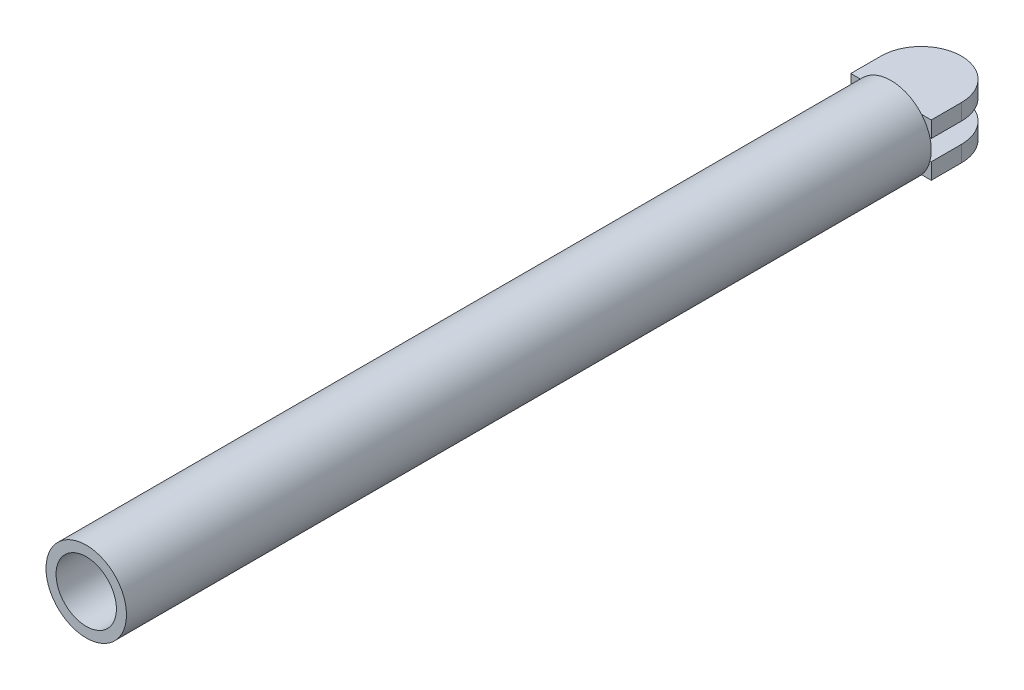
ISO-10303-21;
HEADER;
FILE_DESCRIPTION(('STEP AP214'),'2;1');
FILE_NAME('part.step','',(''),(''),'','','');
FILE_SCHEMA(('AUTOMOTIVE_DESIGN { 1 0 10303 214 1 1 1 1 }'));
ENDSEC;
DATA;
#1=APPLICATION_CONTEXT('core data for automotive mechanical design processes');
#2=APPLICATION_PROTOCOL_DEFINITION('international standard','automotive_design',2000,#1);
#3=PRODUCT_CONTEXT('',#1,'mechanical');
#4=PRODUCT('Part','Part','',(#3));
#5=PRODUCT_RELATED_PRODUCT_CATEGORY('part','',(#4));
#6=PRODUCT_DEFINITION_FORMATION('','',#4);
#7=PRODUCT_DEFINITION_CONTEXT('part definition',#1,'design');
#8=PRODUCT_DEFINITION('design','',#6,#7);
#9=PRODUCT_DEFINITION_SHAPE('','',#8);
#10=(LENGTH_UNIT() NAMED_UNIT(*) SI_UNIT(.MILLI.,.METRE.));
#11=(NAMED_UNIT(*) PLANE_ANGLE_UNIT() SI_UNIT($,.RADIAN.));
#12=(NAMED_UNIT(*) SI_UNIT($,.STERADIAN.) SOLID_ANGLE_UNIT());
#13=UNCERTAINTY_MEASURE_WITH_UNIT(LENGTH_MEASURE(1.E-05),#10,'distance_accuracy_value','');
#14=(GEOMETRIC_REPRESENTATION_CONTEXT(3) GLOBAL_UNCERTAINTY_ASSIGNED_CONTEXT((#13)) GLOBAL_UNIT_ASSIGNED_CONTEXT((#10,
#11,#12)) REPRESENTATION_CONTEXT('',''));
#15=CARTESIAN_POINT('',(0.,0.,0.));
#16=DIRECTION('',(0.,0.,1.));
#17=DIRECTION('',(1.,0.,0.));
#18=AXIS2_PLACEMENT_3D('',#15,#16,#17);
#19=CARTESIAN_POINT('',(0.,0.,-200.));
#20=DIRECTION('',(0.,0.,1.));
#21=DIRECTION('',(1.,0.,0.));
#22=AXIS2_PLACEMENT_3D('',#19,#20,#21);
#23=PLANE('',#22);
#24=DIRECTION('',(1.,0.,0.));
#25=VECTOR('',#24,1.);
#26=CARTESIAN_POINT('',(-20.,-5.,-200.));
#27=LINE('',#26,#25);
#28=CARTESIAN_POINT('',(-19.3649167310371,-5.,-200.));
#29=VERTEX_POINT('',#28);
#30=CARTESIAN_POINT('',(-14.142135623731,-5.,-200.));
#31=VERTEX_POINT('',#30);
#32=EDGE_CURVE('E191',#29,#31,#27,.T.);
#33=ORIENTED_EDGE('',*,*,#32,.F.);
#34=CARTESIAN_POINT('',(0.,0.,-200.));
#35=DIRECTION('',(0.,0.,1.));
#36=DIRECTION('',(1.,0.,0.));
#37=AXIS2_PLACEMENT_3D('',#34,#35,#36);
#38=CIRCLE('',#37,20.);
#39=CARTESIAN_POINT('',(-19.3649167310371,5.,-200.));
#40=VERTEX_POINT('',#39);
#41=EDGE_CURVE('E258',#40,#29,#38,.T.);
#42=ORIENTED_EDGE('',*,*,#41,.F.);
#43=DIRECTION('',(1.,0.,0.));
#44=VECTOR('',#43,1.);
#45=CARTESIAN_POINT('',(-20.,5.,-200.));
#46=LINE('',#45,#44);
#47=CARTESIAN_POINT('',(-14.142135623731,5.,-200.));
#48=VERTEX_POINT('',#47);
#49=EDGE_CURVE('E40',#40,#48,#46,.T.);
#50=ORIENTED_EDGE('',*,*,#49,.T.);
#51=CARTESIAN_POINT('',(0.,0.,-200.));
#52=DIRECTION('',(0.,0.,1.));
#53=DIRECTION('',(1.,0.,0.));
#54=AXIS2_PLACEMENT_3D('',#51,#52,#53);
#55=CIRCLE('',#54,15.);
#56=EDGE_CURVE('E307',#48,#31,#55,.T.);
#57=ORIENTED_EDGE('',*,*,#56,.T.);
#58=EDGE_LOOP('',(#33,#42,#50,#57));
#59=FACE_BOUND('',#58,.T.);
#60=ADVANCED_FACE('F32',(#59),#23,.F.);
#61=CARTESIAN_POINT('',(14.142135623731,-5.,-200.));
#62=VERTEX_POINT('',#61);
#63=CARTESIAN_POINT('',(19.3649167310371,-5.,-200.));
#64=VERTEX_POINT('',#63);
#65=EDGE_CURVE('E319',#62,#64,#27,.T.);
#66=ORIENTED_EDGE('',*,*,#65,.F.);
#67=CARTESIAN_POINT('',(14.142135623731,5.,-200.));
#68=VERTEX_POINT('',#67);
#69=EDGE_CURVE('E240',#62,#68,#55,.T.);
#70=ORIENTED_EDGE('',*,*,#69,.T.);
#71=CARTESIAN_POINT('',(19.3649167310371,5.,-200.));
#72=VERTEX_POINT('',#71);
#73=EDGE_CURVE('E226',#68,#72,#46,.T.);
#74=ORIENTED_EDGE('',*,*,#73,.T.);
#75=EDGE_CURVE('E47',#64,#72,#38,.T.);
#76=ORIENTED_EDGE('',*,*,#75,.F.);
#77=EDGE_LOOP('',(#66,#70,#74,#76));
#78=FACE_BOUND('',#77,.T.);
#79=ADVANCED_FACE('F317',(#78),#23,.F.);
#80=DIRECTION('',(1.,0.,0.));
#81=VECTOR('',#80,1.);
#82=CARTESIAN_POINT('',(-20.,13.,-200.));
#83=LINE('',#82,#81);
#84=CARTESIAN_POINT('',(-15.1986841535707,13.,-200.));
#85=VERTEX_POINT('',#84);
#86=CARTESIAN_POINT('',(-7.48331477354788,13.,-200.));
#87=VERTEX_POINT('',#86);
#88=EDGE_CURVE('E321',#85,#87,#83,.T.);
#89=ORIENTED_EDGE('',*,*,#88,.F.);
#90=CARTESIAN_POINT('',(15.1986841535707,13.,-200.));
#91=VERTEX_POINT('',#90);
#92=EDGE_CURVE('E251',#91,#85,#38,.T.);
#93=ORIENTED_EDGE('',*,*,#92,.F.);
#94=CARTESIAN_POINT('',(7.48331477354788,13.,-200.));
#95=VERTEX_POINT('',#94);
#96=EDGE_CURVE('E212',#95,#91,#83,.T.);
#97=ORIENTED_EDGE('',*,*,#96,.F.);
#98=EDGE_CURVE('E247',#95,#87,#55,.T.);
#99=ORIENTED_EDGE('',*,*,#98,.T.);
#100=EDGE_LOOP('',(#89,#93,#97,#99));
#101=FACE_BOUND('',#100,.T.);
#102=ADVANCED_FACE('F325',(#101),#23,.F.);
#103=CARTESIAN_POINT('',(0.,0.,200.));
#104=DIRECTION('',(0.,0.,1.));
#105=DIRECTION('',(1.,0.,0.));
#106=AXIS2_PLACEMENT_3D('',#103,#104,#105);
#107=PLANE('',#106);
#108=CARTESIAN_POINT('',(0.,0.,200.));
#109=DIRECTION('',(0.,0.,1.));
#110=DIRECTION('',(1.,0.,0.));
#111=AXIS2_PLACEMENT_3D('',#108,#109,#110);
#112=CIRCLE('',#111,20.);
#113=CARTESIAN_POINT('',(20.,0.,200.));
#114=VERTEX_POINT('',#113);
#115=EDGE_CURVE('E248',#114,#114,#112,.T.);
#116=ORIENTED_EDGE('',*,*,#115,.T.);
#117=EDGE_LOOP('',(#116));
#118=FACE_BOUND('',#117,.T.);
#119=CARTESIAN_POINT('',(0.,0.,200.));
#120=DIRECTION('',(0.,0.,1.));
#121=DIRECTION('',(1.,0.,0.));
#122=AXIS2_PLACEMENT_3D('',#119,#120,#121);
#123=CIRCLE('',#122,15.);
#124=CARTESIAN_POINT('',(15.,0.,200.));
#125=VERTEX_POINT('',#124);
#126=EDGE_CURVE('E241',#125,#125,#123,.T.);
#127=ORIENTED_EDGE('',*,*,#126,.F.);
#128=EDGE_LOOP('',(#127));
#129=FACE_BOUND('',#128,.T.);
#130=ADVANCED_FACE('F327',(#118,#129),#107,.T.);
#131=CARTESIAN_POINT('',(-15.1986841535707,-13.,-200.));
#132=VERTEX_POINT('',#131);
#133=CARTESIAN_POINT('',(15.1986841535707,-13.,-200.));
#134=VERTEX_POINT('',#133);
#135=EDGE_CURVE('E257',#132,#134,#38,.T.);
#136=ORIENTED_EDGE('',*,*,#135,.F.);
#137=DIRECTION('',(1.,0.,0.));
#138=VECTOR('',#137,1.);
#139=CARTESIAN_POINT('',(-20.,-13.,-200.));
#140=LINE('',#139,#138);
#141=CARTESIAN_POINT('',(-7.48331477354788,-13.,-200.));
#142=VERTEX_POINT('',#141);
#143=EDGE_CURVE('E170',#132,#142,#140,.T.);
#144=ORIENTED_EDGE('',*,*,#143,.T.);
#145=CARTESIAN_POINT('',(7.48331477354788,-13.,-200.));
#146=VERTEX_POINT('',#145);
#147=EDGE_CURVE('E311',#142,#146,#55,.T.);
#148=ORIENTED_EDGE('',*,*,#147,.T.);
#149=EDGE_CURVE('E55',#146,#134,#140,.T.);
#150=ORIENTED_EDGE('',*,*,#149,.T.);
#151=EDGE_LOOP('',(#136,#144,#148,#150));
#152=FACE_BOUND('',#151,.T.);
#153=ADVANCED_FACE('F328',(#152),#23,.F.);
#154=CARTESIAN_POINT('',(0.,0.,200.));
#155=DIRECTION('',(0.,0.,-1.));
#156=DIRECTION('',(-1.,0.,0.));
#157=AXIS2_PLACEMENT_3D('',#154,#155,#156);
#158=CYLINDRICAL_SURFACE('',#157,20.);
#159=ORIENTED_EDGE('',*,*,#115,.F.);
#160=EDGE_LOOP('',(#159));
#161=FACE_BOUND('',#160,.T.);
#162=EDGE_CURVE('E250',#72,#91,#38,.T.);
#163=ORIENTED_EDGE('',*,*,#162,.T.);
#164=ORIENTED_EDGE('',*,*,#92,.T.);
#165=EDGE_CURVE('E256',#85,#40,#38,.T.);
#166=ORIENTED_EDGE('',*,*,#165,.T.);
#167=ORIENTED_EDGE('',*,*,#41,.T.);
#168=CARTESIAN_POINT('',(0.,0.,-200.));
#169=DIRECTION('',(0.,0.,1.));
#170=DIRECTION('',(1.,0.,0.));
#171=AXIS2_PLACEMENT_3D('',#168,#169,#170);
#172=CIRCLE('',#171,20.);
#173=EDGE_CURVE('E201',#29,#132,#172,.T.);
#174=ORIENTED_EDGE('',*,*,#173,.T.);
#175=ORIENTED_EDGE('',*,*,#135,.T.);
#176=EDGE_CURVE('E195',#134,#64,#172,.T.);
#177=ORIENTED_EDGE('',*,*,#176,.T.);
#178=ORIENTED_EDGE('',*,*,#75,.T.);
#179=EDGE_LOOP('',(#163,#164,#166,#167,#174,#175,#177,#178));
#180=FACE_BOUND('',#179,.T.);
#181=ADVANCED_FACE('F34',(#161,#180),#158,.T.);
#182=CARTESIAN_POINT('',(0.,0.,200.));
#183=DIRECTION('',(0.,0.,-1.));
#184=DIRECTION('',(-1.,0.,0.));
#185=AXIS2_PLACEMENT_3D('',#182,#183,#184);
#186=CYLINDRICAL_SURFACE('',#185,15.);
#187=ORIENTED_EDGE('',*,*,#126,.T.);
#188=EDGE_LOOP('',(#187));
#189=FACE_BOUND('',#188,.T.);
#190=EDGE_CURVE('E244',#68,#95,#55,.T.);
#191=ORIENTED_EDGE('',*,*,#190,.F.);
#192=ORIENTED_EDGE('',*,*,#69,.F.);
#193=EDGE_CURVE('E314',#146,#62,#55,.T.);
#194=ORIENTED_EDGE('',*,*,#193,.F.);
#195=ORIENTED_EDGE('',*,*,#147,.F.);
#196=EDGE_CURVE('E308',#31,#142,#55,.T.);
#197=ORIENTED_EDGE('',*,*,#196,.F.);
#198=ORIENTED_EDGE('',*,*,#56,.F.);
#199=EDGE_CURVE('E303',#87,#48,#55,.T.);
#200=ORIENTED_EDGE('',*,*,#199,.F.);
#201=ORIENTED_EDGE('',*,*,#98,.F.);
#202=EDGE_LOOP('',(#191,#192,#194,#195,#197,#198,#200,#201));
#203=FACE_BOUND('',#202,.T.);
#204=ADVANCED_FACE('F320',(#189,#203),#186,.F.);
#205=CARTESIAN_POINT('',(-20.,13.,-200.));
#206=DIRECTION('',(0.,0.,-1.));
#207=DIRECTION('',(-1.,0.,0.));
#208=AXIS2_PLACEMENT_3D('',#205,#206,#207);
#209=PLANE('',#208);
#210=EDGE_CURVE('E225',#48,#68,#46,.T.);
#211=ORIENTED_EDGE('',*,*,#210,.T.);
#212=ORIENTED_EDGE('',*,*,#190,.T.);
#213=EDGE_CURVE('E211',#87,#95,#83,.T.);
#214=ORIENTED_EDGE('',*,*,#213,.F.);
#215=ORIENTED_EDGE('',*,*,#199,.T.);
#216=EDGE_LOOP('',(#211,#212,#214,#215));
#217=FACE_BOUND('',#216,.T.);
#218=ADVANCED_FACE('F298',(#217),#209,.F.);
#219=ORIENTED_EDGE('',*,*,#162,.F.);
#220=CARTESIAN_POINT('',(20.,5.,-200.));
#221=VERTEX_POINT('',#220);
#222=EDGE_CURVE('E220',#72,#221,#46,.T.);
#223=ORIENTED_EDGE('',*,*,#222,.T.);
#224=DIRECTION('',(0.,-1.,0.));
#225=VECTOR('',#224,1.);
#226=CARTESIAN_POINT('',(20.,13.,-200.));
#227=LINE('',#226,#225);
#228=CARTESIAN_POINT('',(20.,13.,-200.));
#229=VERTEX_POINT('',#228);
#230=EDGE_CURVE('E234',#229,#221,#227,.T.);
#231=ORIENTED_EDGE('',*,*,#230,.F.);
#232=EDGE_CURVE('E205',#91,#229,#83,.T.);
#233=ORIENTED_EDGE('',*,*,#232,.F.);
#234=EDGE_LOOP('',(#219,#223,#231,#233));
#235=FACE_BOUND('',#234,.T.);
#236=ADVANCED_FACE('F294',(#235),#209,.F.);
#237=CARTESIAN_POINT('',(-20.,13.,-200.));
#238=DIRECTION('',(1.,0.,0.));
#239=DIRECTION('',(0.,0.,-1.));
#240=AXIS2_PLACEMENT_3D('',#237,#238,#239);
#241=PLANE('',#240);
#242=DIRECTION('',(0.,0.,1.));
#243=VECTOR('',#242,1.);
#244=CARTESIAN_POINT('',(-20.,5.,-200.));
#245=LINE('',#244,#243);
#246=CARTESIAN_POINT('',(-20.,5.,-215.));
#247=VERTEX_POINT('',#246);
#248=CARTESIAN_POINT('',(-20.,5.,-200.));
#249=VERTEX_POINT('',#248);
#250=EDGE_CURVE('E217',#247,#249,#245,.T.);
#251=ORIENTED_EDGE('',*,*,#250,.T.);
#252=DIRECTION('',(0.,-1.,0.));
#253=VECTOR('',#252,1.);
#254=CARTESIAN_POINT('',(-20.,13.,-200.));
#255=LINE('',#254,#253);
#256=CARTESIAN_POINT('',(-20.,13.,-200.));
#257=VERTEX_POINT('',#256);
#258=EDGE_CURVE('E237',#257,#249,#255,.T.);
#259=ORIENTED_EDGE('',*,*,#258,.F.);
#260=DIRECTION('',(0.,0.,1.));
#261=VECTOR('',#260,1.);
#262=CARTESIAN_POINT('',(-20.,13.,-200.));
#263=LINE('',#262,#261);
#264=CARTESIAN_POINT('',(-20.,13.,-215.));
#265=VERTEX_POINT('',#264);
#266=EDGE_CURVE('E202',#265,#257,#263,.T.);
#267=ORIENTED_EDGE('',*,*,#266,.F.);
#268=DIRECTION('',(0.,-1.,0.));
#269=VECTOR('',#268,1.);
#270=CARTESIAN_POINT('',(-20.,13.,-215.));
#271=LINE('',#270,#269);
#272=EDGE_CURVE('E216',#265,#247,#271,.T.);
#273=ORIENTED_EDGE('',*,*,#272,.T.);
#274=EDGE_LOOP('',(#251,#259,#267,#273));
#275=FACE_BOUND('',#274,.T.);
#276=ADVANCED_FACE('F279',(#275),#241,.F.);
#277=ORIENTED_EDGE('',*,*,#165,.F.);
#278=EDGE_CURVE('E207',#257,#85,#83,.T.);
#279=ORIENTED_EDGE('',*,*,#278,.F.);
#280=ORIENTED_EDGE('',*,*,#258,.T.);
#281=EDGE_CURVE('E221',#249,#40,#46,.T.);
#282=ORIENTED_EDGE('',*,*,#281,.T.);
#283=EDGE_LOOP('',(#277,#279,#280,#282));
#284=FACE_BOUND('',#283,.T.);
#285=ADVANCED_FACE('F275',(#284),#209,.F.);
#286=CARTESIAN_POINT('',(20.,13.,-200.));
#287=DIRECTION('',(-1.,0.,0.));
#288=DIRECTION('',(0.,0.,1.));
#289=AXIS2_PLACEMENT_3D('',#286,#287,#288);
#290=PLANE('',#289);
#291=DIRECTION('',(0.,0.,-1.));
#292=VECTOR('',#291,1.);
#293=CARTESIAN_POINT('',(20.,5.,-200.));
#294=LINE('',#293,#292);
#295=CARTESIAN_POINT('',(20.,5.,-215.));
#296=VERTEX_POINT('',#295);
#297=EDGE_CURVE('E224',#221,#296,#294,.T.);
#298=ORIENTED_EDGE('',*,*,#297,.T.);
#299=DIRECTION('',(0.,-1.,0.));
#300=VECTOR('',#299,1.);
#301=CARTESIAN_POINT('',(20.,13.,-215.));
#302=LINE('',#301,#300);
#303=CARTESIAN_POINT('',(20.,13.,-215.));
#304=VERTEX_POINT('',#303);
#305=EDGE_CURVE('E231',#304,#296,#302,.T.);
#306=ORIENTED_EDGE('',*,*,#305,.F.);
#307=DIRECTION('',(0.,0.,-1.));
#308=VECTOR('',#307,1.);
#309=CARTESIAN_POINT('',(20.,13.,-200.));
#310=LINE('',#309,#308);
#311=EDGE_CURVE('E210',#229,#304,#310,.T.);
#312=ORIENTED_EDGE('',*,*,#311,.F.);
#313=ORIENTED_EDGE('',*,*,#230,.T.);
#314=EDGE_LOOP('',(#298,#306,#312,#313));
#315=FACE_BOUND('',#314,.T.);
#316=ADVANCED_FACE('F290',(#315),#290,.F.);
#317=CARTESIAN_POINT('',(0.,13.,-215.));
#318=DIRECTION('',(0.,-1.,0.));
#319=DIRECTION('',(0.,0.,-1.));
#320=AXIS2_PLACEMENT_3D('',#317,#318,#319);
#321=CYLINDRICAL_SURFACE('',#320,20.);
#322=CARTESIAN_POINT('',(0.,5.,-215.));
#323=DIRECTION('',(0.,1.,0.));
#324=DIRECTION('',(0.,0.,-1.));
#325=AXIS2_PLACEMENT_3D('',#322,#323,#324);
#326=CIRCLE('',#325,20.);
#327=EDGE_CURVE('E206',#296,#247,#326,.T.);
#328=ORIENTED_EDGE('',*,*,#327,.T.);
#329=ORIENTED_EDGE('',*,*,#272,.F.);
#330=CARTESIAN_POINT('',(0.,13.,-215.));
#331=DIRECTION('',(0.,1.,0.));
#332=DIRECTION('',(0.,0.,-1.));
#333=AXIS2_PLACEMENT_3D('',#330,#331,#332);
#334=CIRCLE('',#333,20.);
#335=EDGE_CURVE('E214',#304,#265,#334,.T.);
#336=ORIENTED_EDGE('',*,*,#335,.F.);
#337=ORIENTED_EDGE('',*,*,#305,.T.);
#338=EDGE_LOOP('',(#328,#329,#336,#337));
#339=FACE_BOUND('',#338,.T.);
#340=ADVANCED_FACE('F285',(#339),#321,.T.);
#341=CARTESIAN_POINT('',(0.,13.,-215.));
#342=DIRECTION('',(0.,-1.,0.));
#343=DIRECTION('',(0.,0.,-1.));
#344=AXIS2_PLACEMENT_3D('',#341,#342,#343);
#345=PLANE('',#344);
#346=ORIENTED_EDGE('',*,*,#266,.T.);
#347=ORIENTED_EDGE('',*,*,#278,.T.);
#348=ORIENTED_EDGE('',*,*,#88,.T.);
#349=ORIENTED_EDGE('',*,*,#213,.T.);
#350=ORIENTED_EDGE('',*,*,#96,.T.);
#351=ORIENTED_EDGE('',*,*,#232,.T.);
#352=ORIENTED_EDGE('',*,*,#311,.T.);
#353=ORIENTED_EDGE('',*,*,#335,.T.);
#354=EDGE_LOOP('',(#346,#347,#348,#349,#350,#351,#352,#353));
#355=FACE_BOUND('',#354,.T.);
#356=ADVANCED_FACE('F323',(#355),#345,.F.);
#357=CARTESIAN_POINT('',(0.,5.,-215.));
#358=DIRECTION('',(0.,-1.,0.));
#359=DIRECTION('',(0.,0.,-1.));
#360=AXIS2_PLACEMENT_3D('',#357,#358,#359);
#361=PLANE('',#360);
#362=CARTESIAN_POINT('',(0.,5.,-215.));
#363=DIRECTION('',(0.,-1.,0.));
#364=DIRECTION('',(0.,0.,-1.));
#365=AXIS2_PLACEMENT_3D('',#362,#363,#364);
#366=CIRCLE('',#365,3.5);
#367=CARTESIAN_POINT('',(0.,5.,-218.5));
#368=VERTEX_POINT('',#367);
#369=EDGE_CURVE('E11',#368,#368,#366,.T.);
#370=ORIENTED_EDGE('',*,*,#369,.F.);
#371=EDGE_LOOP('',(#370));
#372=FACE_BOUND('',#371,.T.);
#373=ORIENTED_EDGE('',*,*,#250,.F.);
#374=ORIENTED_EDGE('',*,*,#327,.F.);
#375=ORIENTED_EDGE('',*,*,#297,.F.);
#376=ORIENTED_EDGE('',*,*,#222,.F.);
#377=ORIENTED_EDGE('',*,*,#73,.F.);
#378=ORIENTED_EDGE('',*,*,#210,.F.);
#379=ORIENTED_EDGE('',*,*,#49,.F.);
#380=ORIENTED_EDGE('',*,*,#281,.F.);
#381=EDGE_LOOP('',(#373,#374,#375,#376,#377,#378,#379,#380));
#382=FACE_BOUND('',#381,.T.);
#383=ADVANCED_FACE('F269',(#372,#382),#361,.T.);
#384=CARTESIAN_POINT('',(-20.,-13.,-200.));
#385=DIRECTION('',(0.,0.,1.));
#386=DIRECTION('',(1.,0.,0.));
#387=AXIS2_PLACEMENT_3D('',#384,#385,#386);
#388=PLANE('',#387);
#389=EDGE_CURVE('E341',#31,#62,#27,.T.);
#390=ORIENTED_EDGE('',*,*,#389,.F.);
#391=ORIENTED_EDGE('',*,*,#196,.T.);
#392=EDGE_CURVE('E355',#142,#146,#140,.T.);
#393=ORIENTED_EDGE('',*,*,#392,.T.);
#394=ORIENTED_EDGE('',*,*,#193,.T.);
#395=EDGE_LOOP('',(#390,#391,#393,#394));
#396=FACE_BOUND('',#395,.T.);
#397=ADVANCED_FACE('F356',(#396),#388,.T.);
#398=ORIENTED_EDGE('',*,*,#173,.F.);
#399=CARTESIAN_POINT('',(-20.,-5.,-200.));
#400=VERTEX_POINT('',#399);
#401=EDGE_CURVE('E153',#400,#29,#27,.T.);
#402=ORIENTED_EDGE('',*,*,#401,.F.);
#403=DIRECTION('',(0.,1.,0.));
#404=VECTOR('',#403,1.);
#405=CARTESIAN_POINT('',(-20.,-13.,-200.));
#406=LINE('',#405,#404);
#407=CARTESIAN_POINT('',(-20.,-13.,-200.));
#408=VERTEX_POINT('',#407);
#409=EDGE_CURVE('E147',#408,#400,#406,.T.);
#410=ORIENTED_EDGE('',*,*,#409,.F.);
#411=EDGE_CURVE('E151',#408,#132,#140,.T.);
#412=ORIENTED_EDGE('',*,*,#411,.T.);
#413=EDGE_LOOP('',(#398,#402,#410,#412));
#414=FACE_BOUND('',#413,.T.);
#415=ADVANCED_FACE('F150',(#414),#388,.T.);
#416=CARTESIAN_POINT('',(-20.,-13.,-200.));
#417=DIRECTION('',(-1.,0.,0.));
#418=DIRECTION('',(0.,0.,1.));
#419=AXIS2_PLACEMENT_3D('',#416,#417,#418);
#420=PLANE('',#419);
#421=DIRECTION('',(0.,0.,1.));
#422=VECTOR('',#421,1.);
#423=CARTESIAN_POINT('',(-20.,-5.,-200.));
#424=LINE('',#423,#422);
#425=CARTESIAN_POINT('',(-20.,-5.,-215.));
#426=VERTEX_POINT('',#425);
#427=EDGE_CURVE('E187',#426,#400,#424,.T.);
#428=ORIENTED_EDGE('',*,*,#427,.F.);
#429=DIRECTION('',(0.,1.,0.));
#430=VECTOR('',#429,1.);
#431=CARTESIAN_POINT('',(-20.,-13.,-215.));
#432=LINE('',#431,#430);
#433=CARTESIAN_POINT('',(-20.,-13.,-215.));
#434=VERTEX_POINT('',#433);
#435=EDGE_CURVE('E175',#434,#426,#432,.T.);
#436=ORIENTED_EDGE('',*,*,#435,.F.);
#437=DIRECTION('',(0.,0.,1.));
#438=VECTOR('',#437,1.);
#439=CARTESIAN_POINT('',(-20.,-13.,-200.));
#440=LINE('',#439,#438);
#441=EDGE_CURVE('E166',#434,#408,#440,.T.);
#442=ORIENTED_EDGE('',*,*,#441,.T.);
#443=ORIENTED_EDGE('',*,*,#409,.T.);
#444=EDGE_LOOP('',(#428,#436,#442,#443));
#445=FACE_BOUND('',#444,.T.);
#446=ADVANCED_FACE('F174',(#445),#420,.T.);
#447=CARTESIAN_POINT('',(0.,-13.,-215.));
#448=DIRECTION('',(0.,1.,0.));
#449=DIRECTION('',(0.,0.,1.));
#450=AXIS2_PLACEMENT_3D('',#447,#448,#449);
#451=CYLINDRICAL_SURFACE('',#450,20.);
#452=CARTESIAN_POINT('',(0.,-5.,-215.));
#453=DIRECTION('',(0.,1.,0.));
#454=DIRECTION('',(0.,0.,-1.));
#455=AXIS2_PLACEMENT_3D('',#452,#453,#454);
#456=CIRCLE('',#455,20.);
#457=CARTESIAN_POINT('',(20.,-5.,-215.));
#458=VERTEX_POINT('',#457);
#459=EDGE_CURVE('E176',#458,#426,#456,.T.);
#460=ORIENTED_EDGE('',*,*,#459,.F.);
#461=DIRECTION('',(0.,1.,0.));
#462=VECTOR('',#461,1.);
#463=CARTESIAN_POINT('',(20.,-13.,-215.));
#464=LINE('',#463,#462);
#465=CARTESIAN_POINT('',(20.,-13.,-215.));
#466=VERTEX_POINT('',#465);
#467=EDGE_CURVE('E196',#466,#458,#464,.T.);
#468=ORIENTED_EDGE('',*,*,#467,.F.);
#469=CARTESIAN_POINT('',(0.,-13.,-215.));
#470=DIRECTION('',(0.,1.,0.));
#471=DIRECTION('',(0.,0.,-1.));
#472=AXIS2_PLACEMENT_3D('',#469,#470,#471);
#473=CIRCLE('',#472,20.);
#474=EDGE_CURVE('E159',#466,#434,#473,.T.);
#475=ORIENTED_EDGE('',*,*,#474,.T.);
#476=ORIENTED_EDGE('',*,*,#435,.T.);
#477=EDGE_LOOP('',(#460,#468,#475,#476));
#478=FACE_BOUND('',#477,.T.);
#479=ADVANCED_FACE('F354',(#478),#451,.T.);
#480=CARTESIAN_POINT('',(20.,-13.,-200.));
#481=DIRECTION('',(1.,0.,0.));
#482=DIRECTION('',(0.,0.,-1.));
#483=AXIS2_PLACEMENT_3D('',#480,#481,#482);
#484=PLANE('',#483);
#485=DIRECTION('',(0.,0.,-1.));
#486=VECTOR('',#485,1.);
#487=CARTESIAN_POINT('',(20.,-5.,-200.));
#488=LINE('',#487,#486);
#489=CARTESIAN_POINT('',(20.,-5.,-200.));
#490=VERTEX_POINT('',#489);
#491=EDGE_CURVE('E179',#490,#458,#488,.T.);
#492=ORIENTED_EDGE('',*,*,#491,.F.);
#493=DIRECTION('',(0.,1.,0.));
#494=VECTOR('',#493,1.);
#495=CARTESIAN_POINT('',(20.,-13.,-200.));
#496=LINE('',#495,#494);
#497=CARTESIAN_POINT('',(20.,-13.,-200.));
#498=VERTEX_POINT('',#497);
#499=EDGE_CURVE('E158',#498,#490,#496,.T.);
#500=ORIENTED_EDGE('',*,*,#499,.F.);
#501=DIRECTION('',(0.,0.,-1.));
#502=VECTOR('',#501,1.);
#503=CARTESIAN_POINT('',(20.,-13.,-200.));
#504=LINE('',#503,#502);
#505=EDGE_CURVE('E171',#498,#466,#504,.T.);
#506=ORIENTED_EDGE('',*,*,#505,.T.);
#507=ORIENTED_EDGE('',*,*,#467,.T.);
#508=EDGE_LOOP('',(#492,#500,#506,#507));
#509=FACE_BOUND('',#508,.T.);
#510=ADVANCED_FACE('F352',(#509),#484,.T.);
#511=ORIENTED_EDGE('',*,*,#176,.F.);
#512=EDGE_CURVE('E173',#134,#498,#140,.T.);
#513=ORIENTED_EDGE('',*,*,#512,.T.);
#514=ORIENTED_EDGE('',*,*,#499,.T.);
#515=EDGE_CURVE('E189',#64,#490,#27,.T.);
#516=ORIENTED_EDGE('',*,*,#515,.F.);
#517=EDGE_LOOP('',(#511,#513,#514,#516));
#518=FACE_BOUND('',#517,.T.);
#519=ADVANCED_FACE('F348',(#518),#388,.T.);
#520=CARTESIAN_POINT('',(0.,-13.,-215.));
#521=DIRECTION('',(0.,-1.,0.));
#522=DIRECTION('',(0.,0.,-1.));
#523=AXIS2_PLACEMENT_3D('',#520,#521,#522);
#524=PLANE('',#523);
#525=ORIENTED_EDGE('',*,*,#441,.F.);
#526=ORIENTED_EDGE('',*,*,#474,.F.);
#527=ORIENTED_EDGE('',*,*,#505,.F.);
#528=ORIENTED_EDGE('',*,*,#512,.F.);
#529=ORIENTED_EDGE('',*,*,#149,.F.);
#530=ORIENTED_EDGE('',*,*,#392,.F.);
#531=ORIENTED_EDGE('',*,*,#143,.F.);
#532=ORIENTED_EDGE('',*,*,#411,.F.);
#533=EDGE_LOOP('',(#525,#526,#527,#528,#529,#530,#531,#532));
#534=FACE_BOUND('',#533,.T.);
#535=ADVANCED_FACE('F164',(#534),#524,.T.);
#536=CARTESIAN_POINT('',(0.,-5.,-215.));
#537=DIRECTION('',(0.,-1.,0.));
#538=DIRECTION('',(0.,0.,-1.));
#539=AXIS2_PLACEMENT_3D('',#536,#537,#538);
#540=PLANE('',#539);
#541=CARTESIAN_POINT('',(0.,-5.,-215.));
#542=DIRECTION('',(0.,-1.,0.));
#543=DIRECTION('',(0.,0.,-1.));
#544=AXIS2_PLACEMENT_3D('',#541,#542,#543);
#545=CIRCLE('',#544,3.5);
#546=CARTESIAN_POINT('',(0.,-5.,-218.5));
#547=VERTEX_POINT('',#546);
#548=EDGE_CURVE('E182',#547,#547,#545,.T.);
#549=ORIENTED_EDGE('',*,*,#548,.T.);
#550=EDGE_LOOP('',(#549));
#551=FACE_BOUND('',#550,.T.);
#552=ORIENTED_EDGE('',*,*,#427,.T.);
#553=ORIENTED_EDGE('',*,*,#401,.T.);
#554=ORIENTED_EDGE('',*,*,#32,.T.);
#555=ORIENTED_EDGE('',*,*,#389,.T.);
#556=ORIENTED_EDGE('',*,*,#65,.T.);
#557=ORIENTED_EDGE('',*,*,#515,.T.);
#558=ORIENTED_EDGE('',*,*,#491,.T.);
#559=ORIENTED_EDGE('',*,*,#459,.T.);
#560=EDGE_LOOP('',(#552,#553,#554,#555,#556,#557,#558,#559));
#561=FACE_BOUND('',#560,.T.);
#562=ADVANCED_FACE('F343',(#551,#561),#540,.F.);
#563=CARTESIAN_POINT('',(0.,5.,-215.));
#564=DIRECTION('',(0.,-1.,0.));
#565=DIRECTION('',(0.,0.,-1.));
#566=AXIS2_PLACEMENT_3D('',#563,#564,#565);
#567=CYLINDRICAL_SURFACE('',#566,3.5);
#568=ORIENTED_EDGE('',*,*,#369,.T.);
#569=EDGE_LOOP('',(#568));
#570=FACE_BOUND('',#569,.T.);
#571=ORIENTED_EDGE('',*,*,#548,.F.);
#572=EDGE_LOOP('',(#571));
#573=FACE_BOUND('',#572,.T.);
#574=ADVANCED_FACE('F379',(#570,#573),#567,.T.);
#575=CLOSED_SHELL('',(#60,#79,#102,#130,#153,#181,#204,#218,#236,#276,#285,#316,#340,#356,#383,
#397,#415,#446,#479,#510,#519,#535,#562,#574));
#576=MANIFOLD_SOLID_BREP('B2',#575);
#577=ADVANCED_BREP_SHAPE_REPRESENTATION('',(#18,#576),#14);
#578=SHAPE_DEFINITION_REPRESENTATION(#9,#577);
ENDSEC;
END-ISO-10303-21;
